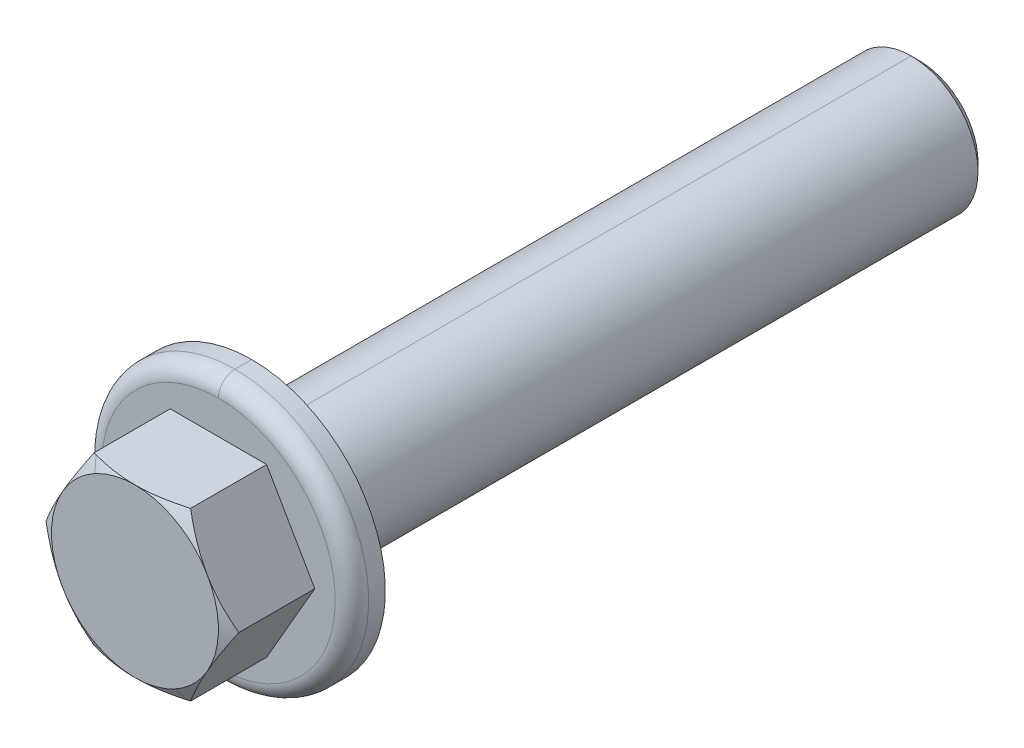
ISO-10303-21;
HEADER;
FILE_DESCRIPTION(('STEP AP214'),'2;1');
FILE_NAME('part.step','',(''),(''),'','','');
FILE_SCHEMA(('AUTOMOTIVE_DESIGN { 1 0 10303 214 1 1 1 1 }'));
ENDSEC;
DATA;
#1=APPLICATION_CONTEXT('core data for automotive mechanical design processes');
#2=APPLICATION_PROTOCOL_DEFINITION('international standard','automotive_design',2000,#1);
#3=PRODUCT_CONTEXT('',#1,'mechanical');
#4=PRODUCT('Part','Part','',(#3));
#5=PRODUCT_RELATED_PRODUCT_CATEGORY('part','',(#4));
#6=PRODUCT_DEFINITION_FORMATION('','',#4);
#7=PRODUCT_DEFINITION_CONTEXT('part definition',#1,'design');
#8=PRODUCT_DEFINITION('design','',#6,#7);
#9=PRODUCT_DEFINITION_SHAPE('','',#8);
#10=(LENGTH_UNIT() NAMED_UNIT(*) SI_UNIT(.MILLI.,.METRE.));
#11=(NAMED_UNIT(*) PLANE_ANGLE_UNIT() SI_UNIT($,.RADIAN.));
#12=(NAMED_UNIT(*) SI_UNIT($,.STERADIAN.) SOLID_ANGLE_UNIT());
#13=UNCERTAINTY_MEASURE_WITH_UNIT(LENGTH_MEASURE(1.E-05),#10,'distance_accuracy_value','');
#14=(GEOMETRIC_REPRESENTATION_CONTEXT(3) GLOBAL_UNCERTAINTY_ASSIGNED_CONTEXT((#13)) GLOBAL_UNIT_ASSIGNED_CONTEXT((#10,
#11,#12)) REPRESENTATION_CONTEXT('',''));
#15=CARTESIAN_POINT('',(0.,0.,0.));
#16=DIRECTION('',(0.,0.,1.));
#17=DIRECTION('',(1.,0.,0.));
#18=AXIS2_PLACEMENT_3D('',#15,#16,#17);
#19=CARTESIAN_POINT('',(-62.,72.,24.3));
#20=DIRECTION('',(0.,0.,1.));
#21=DIRECTION('',(-1.,0.,0.));
#22=AXIS2_PLACEMENT_3D('',#19,#20,#21);
#23=TOROIDAL_SURFACE('',#22,4.25,0.25);
#24=CARTESIAN_POINT('',(-62.,72.,24.55));
#25=DIRECTION('',(0.,0.,-1.));
#26=DIRECTION('',(1.,0.,0.));
#27=AXIS2_PLACEMENT_3D('',#24,#25,#26);
#28=CIRCLE('',#27,4.25);
#29=CARTESIAN_POINT('',(-62.,76.25,24.55));
#30=VERTEX_POINT('',#29);
#31=CARTESIAN_POINT('',(-62.,67.75,24.55));
#32=VERTEX_POINT('',#31);
#33=EDGE_CURVE('E11',#30,#32,#28,.T.);
#34=ORIENTED_EDGE('',*,*,#33,.T.);
#35=CARTESIAN_POINT('',(-62.,67.75,24.3));
#36=DIRECTION('',(-1.,0.,0.));
#37=DIRECTION('',(0.,0.,1.));
#38=AXIS2_PLACEMENT_3D('',#35,#36,#37);
#39=CIRCLE('',#38,0.25);
#40=CARTESIAN_POINT('',(-62.,68.,24.3));
#41=VERTEX_POINT('',#40);
#42=EDGE_CURVE('E33',#32,#41,#39,.T.);
#43=ORIENTED_EDGE('',*,*,#42,.T.);
#44=CARTESIAN_POINT('',(-62.,72.,24.3));
#45=DIRECTION('',(0.,0.,-1.));
#46=DIRECTION('',(1.,0.,0.));
#47=AXIS2_PLACEMENT_3D('',#44,#45,#46);
#48=CIRCLE('',#47,4.);
#49=CARTESIAN_POINT('',(-62.,76.,24.3));
#50=VERTEX_POINT('',#49);
#51=EDGE_CURVE('E461',#50,#41,#48,.T.);
#52=ORIENTED_EDGE('',*,*,#51,.F.);
#53=CARTESIAN_POINT('',(-62.,76.25,24.3));
#54=DIRECTION('',(1.,0.,0.));
#55=DIRECTION('',(0.,0.,1.));
#56=AXIS2_PLACEMENT_3D('',#53,#54,#55);
#57=CIRCLE('',#56,0.25);
#58=EDGE_CURVE('E457',#30,#50,#57,.T.);
#59=ORIENTED_EDGE('',*,*,#58,.F.);
#60=EDGE_LOOP('',(#34,#43,#52,#59));
#61=FACE_BOUND('',#60,.T.);
#62=ADVANCED_FACE('F17',(#61),#23,.F.);
#63=CARTESIAN_POINT('',(-62.,72.,24.3));
#64=DIRECTION('',(0.,0.,1.));
#65=DIRECTION('',(0.,-1.,0.));
#66=AXIS2_PLACEMENT_3D('',#63,#64,#65);
#67=TOROIDAL_SURFACE('',#66,4.25,0.25);
#68=CARTESIAN_POINT('',(-62.,72.,24.55));
#69=DIRECTION('',(0.,0.,-1.));
#70=DIRECTION('',(1.,0.,0.));
#71=AXIS2_PLACEMENT_3D('',#68,#69,#70);
#72=CIRCLE('',#71,4.25);
#73=EDGE_CURVE('E454',#32,#30,#72,.T.);
#74=ORIENTED_EDGE('',*,*,#73,.T.);
#75=ORIENTED_EDGE('',*,*,#58,.T.);
#76=CARTESIAN_POINT('',(-62.,72.,24.3));
#77=DIRECTION('',(0.,0.,-1.));
#78=DIRECTION('',(1.,0.,0.));
#79=AXIS2_PLACEMENT_3D('',#76,#77,#78);
#80=CIRCLE('',#79,4.);
#81=EDGE_CURVE('E465',#41,#50,#80,.T.);
#82=ORIENTED_EDGE('',*,*,#81,.F.);
#83=ORIENTED_EDGE('',*,*,#42,.F.);
#84=EDGE_LOOP('',(#74,#75,#82,#83));
#85=FACE_BOUND('',#84,.T.);
#86=ADVANCED_FACE('F311',(#85),#67,.F.);
#87=CARTESIAN_POINT('',(-62.,72.,4.55));
#88=DIRECTION('',(0.,0.,1.));
#89=DIRECTION('',(-1.,0.,0.));
#90=AXIS2_PLACEMENT_3D('',#87,#88,#89);
#91=CYLINDRICAL_SURFACE('',#90,4.);
#92=DIRECTION('',(0.,0.,-1.));
#93=VECTOR('',#92,1.);
#94=CARTESIAN_POINT('',(-62.,76.,4.55));
#95=LINE('',#94,#93);
#96=CARTESIAN_POINT('',(-62.,76.,-14.95));
#97=VERTEX_POINT('',#96);
#98=EDGE_CURVE('E468',#50,#97,#95,.T.);
#99=ORIENTED_EDGE('',*,*,#98,.F.);
#100=ORIENTED_EDGE('',*,*,#51,.T.);
#101=DIRECTION('',(0.,0.,-1.));
#102=VECTOR('',#101,1.);
#103=CARTESIAN_POINT('',(-62.,68.,4.55));
#104=LINE('',#103,#102);
#105=CARTESIAN_POINT('',(-62.,68.,-14.95));
#106=VERTEX_POINT('',#105);
#107=EDGE_CURVE('E472',#41,#106,#104,.T.);
#108=ORIENTED_EDGE('',*,*,#107,.T.);
#109=CARTESIAN_POINT('',(-62.,72.,-14.95));
#110=DIRECTION('',(0.,0.,1.));
#111=DIRECTION('',(1.,0.,0.));
#112=AXIS2_PLACEMENT_3D('',#109,#110,#111);
#113=CIRCLE('',#112,4.);
#114=EDGE_CURVE('E467',#106,#97,#113,.T.);
#115=ORIENTED_EDGE('',*,*,#114,.T.);
#116=EDGE_LOOP('',(#99,#100,#108,#115));
#117=FACE_BOUND('',#116,.T.);
#118=ADVANCED_FACE('F317',(#117),#91,.T.);
#119=CARTESIAN_POINT('',(-62.,72.,4.55));
#120=DIRECTION('',(0.,0.,1.));
#121=DIRECTION('',(-1.,0.,0.));
#122=AXIS2_PLACEMENT_3D('',#119,#120,#121);
#123=CYLINDRICAL_SURFACE('',#122,4.);
#124=ORIENTED_EDGE('',*,*,#107,.F.);
#125=ORIENTED_EDGE('',*,*,#81,.T.);
#126=ORIENTED_EDGE('',*,*,#98,.T.);
#127=CARTESIAN_POINT('',(-62.,72.,-14.95));
#128=DIRECTION('',(0.,0.,1.));
#129=DIRECTION('',(1.,0.,0.));
#130=AXIS2_PLACEMENT_3D('',#127,#128,#129);
#131=CIRCLE('',#130,4.);
#132=EDGE_CURVE('E471',#97,#106,#131,.T.);
#133=ORIENTED_EDGE('',*,*,#132,.T.);
#134=EDGE_LOOP('',(#124,#125,#126,#133));
#135=FACE_BOUND('',#134,.T.);
#136=ADVANCED_FACE('F322',(#135),#123,.T.);
#137=CARTESIAN_POINT('',(-62.,72.,-18.95));
#138=DIRECTION('',(0.,0.,1.));
#139=DIRECTION('',(-0.274319226534887,-0.961638685761602,0.));
#140=AXIS2_PLACEMENT_3D('',#137,#138,#139);
#141=CONICAL_SURFACE('',#140,0.,0.785398163396999);
#142=DIRECTION('',(1.71127574250888E-07,0.707106781186537,-0.707106781186537));
#143=VECTOR('',#142,1.);
#144=CARTESIAN_POINT('',(-62.0000009075411,68.25,-15.2));
#145=LINE('',#144,#143);
#146=CARTESIAN_POINT('',(-62.0000002619931,68.5,-15.45));
#147=VERTEX_POINT('',#146);
#148=EDGE_CURVE('E478',#106,#147,#145,.T.);
#149=ORIENTED_EDGE('',*,*,#148,.T.);
#150=CARTESIAN_POINT('',(-62.,72.,-15.45));
#151=DIRECTION('',(0.,0.,1.));
#152=DIRECTION('',(-0.961638685761684,0.2743192265346,0.));
#153=AXIS2_PLACEMENT_3D('',#150,#151,#152);
#154=CIRCLE('',#153,3.5);
#155=CARTESIAN_POINT('',(-62.,75.5,-15.45));
#156=VERTEX_POINT('',#155);
#157=EDGE_CURVE('E481',#147,#156,#154,.T.);
#158=ORIENTED_EDGE('',*,*,#157,.T.);
#159=DIRECTION('',(0.,-0.707106781186548,-0.707106781186548));
#160=VECTOR('',#159,1.);
#161=CARTESIAN_POINT('',(-62.,75.75,-15.2));
#162=LINE('',#161,#160);
#163=EDGE_CURVE('E484',#97,#156,#162,.T.);
#164=ORIENTED_EDGE('',*,*,#163,.F.);
#165=ORIENTED_EDGE('',*,*,#114,.F.);
#166=EDGE_LOOP('',(#149,#158,#164,#165));
#167=FACE_BOUND('',#166,.T.);
#168=ADVANCED_FACE('F326',(#167),#141,.T.);
#169=CARTESIAN_POINT('',(-62.0000000000012,71.9999999999992,-18.95));
#170=DIRECTION('',(3.05977465587E-13,1.97175609173E-13,1.));
#171=DIRECTION('',(0.,1.,-1.97175609173E-13));
#172=AXIS2_PLACEMENT_3D('',#169,#170,#171);
#173=CONICAL_SURFACE('',#172,0.,0.785398163396999);
#174=ORIENTED_EDGE('',*,*,#163,.T.);
#175=CARTESIAN_POINT('',(-62.,72.,-15.4499999999993));
#176=DIRECTION('',(3.05977465587E-13,0.,1.));
#177=DIRECTION('',(-1.,0.,3.05977465587E-13));
#178=AXIS2_PLACEMENT_3D('',#175,#176,#177);
#179=CIRCLE('',#178,3.5);
#180=EDGE_CURVE('E352',#156,#147,#179,.T.);
#181=ORIENTED_EDGE('',*,*,#180,.T.);
#182=ORIENTED_EDGE('',*,*,#148,.F.);
#183=ORIENTED_EDGE('',*,*,#132,.F.);
#184=EDGE_LOOP('',(#174,#181,#182,#183));
#185=FACE_BOUND('',#184,.T.);
#186=ADVANCED_FACE('F330',(#185),#173,.T.);
#187=CARTESIAN_POINT('',(-62.,72.,-15.45));
#188=DIRECTION('',(0.,0.,1.));
#189=DIRECTION('',(0.,-1.,0.));
#190=AXIS2_PLACEMENT_3D('',#187,#188,#189);
#191=PLANE('',#190);
#192=ORIENTED_EDGE('',*,*,#180,.F.);
#193=ORIENTED_EDGE('',*,*,#157,.F.);
#194=EDGE_LOOP('',(#192,#193));
#195=FACE_BOUND('',#194,.T.);
#196=ADVANCED_FACE('F334',(#195),#191,.F.);
#197=CARTESIAN_POINT('',(-62.,72.,31.55));
#198=DIRECTION('',(0.,0.,1.));
#199=DIRECTION('',(-1.,0.,0.));
#200=AXIS2_PLACEMENT_3D('',#197,#198,#199);
#201=PLANE('',#200);
#202=CARTESIAN_POINT('',(-62.,72.,31.55));
#203=DIRECTION('',(0.,0.,1.));
#204=DIRECTION('',(1.,0.,0.));
#205=AXIS2_PLACEMENT_3D('',#202,#203,#204);
#206=CIRCLE('',#205,5.);
#207=CARTESIAN_POINT('',(-66.3301270189226,74.5000000000015,31.5499999999994));
#208=VERTEX_POINT('',#207);
#209=CARTESIAN_POINT('',(-66.3301270189228,69.4999999999984,31.5499999999993));
#210=VERTEX_POINT('',#209);
#211=EDGE_CURVE('E347',#208,#210,#206,.T.);
#212=ORIENTED_EDGE('',*,*,#211,.T.);
#213=CARTESIAN_POINT('',(-62.,72.,31.55));
#214=DIRECTION('',(0.,0.,1.));
#215=DIRECTION('',(1.,0.,0.));
#216=AXIS2_PLACEMENT_3D('',#213,#214,#215);
#217=CIRCLE('',#216,5.);
#218=CARTESIAN_POINT('',(-62.,67.,31.55));
#219=VERTEX_POINT('',#218);
#220=EDGE_CURVE('E353',#210,#219,#217,.T.);
#221=ORIENTED_EDGE('',*,*,#220,.T.);
#222=CARTESIAN_POINT('',(-62.,72.,31.55));
#223=DIRECTION('',(0.,0.,1.));
#224=DIRECTION('',(1.,0.,0.));
#225=AXIS2_PLACEMENT_3D('',#222,#223,#224);
#226=CIRCLE('',#225,5.);
#227=CARTESIAN_POINT('',(-59.60287230698,67.61208719055,31.55));
#228=VERTEX_POINT('',#227);
#229=EDGE_CURVE('E368',#219,#228,#226,.T.);
#230=ORIENTED_EDGE('',*,*,#229,.T.);
#231=CARTESIAN_POINT('',(-62.,72.,31.55));
#232=DIRECTION('',(0.,0.,1.));
#233=DIRECTION('',(1.,0.,0.));
#234=AXIS2_PLACEMENT_3D('',#231,#232,#233);
#235=CIRCLE('',#234,5.);
#236=CARTESIAN_POINT('',(-57.6698729810774,69.4999999999985,31.5499999999994));
#237=VERTEX_POINT('',#236);
#238=EDGE_CURVE('E372',#228,#237,#235,.T.);
#239=ORIENTED_EDGE('',*,*,#238,.T.);
#240=CARTESIAN_POINT('',(-62.,72.,31.55));
#241=DIRECTION('',(0.,0.,1.));
#242=DIRECTION('',(1.,0.,0.));
#243=AXIS2_PLACEMENT_3D('',#240,#241,#242);
#244=CIRCLE('',#243,5.);
#245=CARTESIAN_POINT('',(-57.6698729810772,74.5000000000016,31.5499999999993));
#246=VERTEX_POINT('',#245);
#247=EDGE_CURVE('E172',#237,#246,#244,.T.);
#248=ORIENTED_EDGE('',*,*,#247,.T.);
#249=CARTESIAN_POINT('',(-62.,72.,31.55));
#250=DIRECTION('',(0.,0.,1.));
#251=DIRECTION('',(1.,0.,0.));
#252=AXIS2_PLACEMENT_3D('',#249,#250,#251);
#253=CIRCLE('',#252,5.);
#254=CARTESIAN_POINT('',(-62.,77.,31.55));
#255=VERTEX_POINT('',#254);
#256=EDGE_CURVE('E147',#246,#255,#253,.T.);
#257=ORIENTED_EDGE('',*,*,#256,.T.);
#258=CARTESIAN_POINT('',(-62.,72.,31.55));
#259=DIRECTION('',(0.,0.,1.));
#260=DIRECTION('',(1.,0.,0.));
#261=AXIS2_PLACEMENT_3D('',#258,#259,#260);
#262=CIRCLE('',#261,5.);
#263=CARTESIAN_POINT('',(-64.39712769302,76.38791280945,31.55));
#264=VERTEX_POINT('',#263);
#265=EDGE_CURVE('E160',#255,#264,#262,.T.);
#266=ORIENTED_EDGE('',*,*,#265,.T.);
#267=CARTESIAN_POINT('',(-62.,72.,31.55));
#268=DIRECTION('',(0.,0.,1.));
#269=DIRECTION('',(1.,0.,0.));
#270=AXIS2_PLACEMENT_3D('',#267,#268,#269);
#271=CIRCLE('',#270,5.);
#272=EDGE_CURVE('E166',#264,#208,#271,.T.);
#273=ORIENTED_EDGE('',*,*,#272,.T.);
#274=EDGE_LOOP('',(#212,#221,#230,#239,#248,#257,#266,#273));
#275=FACE_BOUND('',#274,.T.);
#276=ADVANCED_FACE('F169',(#275),#201,.T.);
#277=CARTESIAN_POINT('',(-62.,72.,31.55));
#278=DIRECTION('',(0.,0.,-1.));
#279=DIRECTION('',(-0.479425538604204,0.877582561890372,0.));
#280=AXIS2_PLACEMENT_3D('',#277,#278,#279);
#281=CONICAL_SURFACE('',#280,5.,1.0471975512);
#282=ORIENTED_EDGE('',*,*,#211,.F.);
#283=CARTESIAN_POINT('',(-67.7735026919003,71.9999999999987,31.103418012616));
#284=CARTESIAN_POINT('',(-67.6560125271063,72.2034989348116,31.1712680083954));
#285=CARTESIAN_POINT('',(-67.5375814588518,72.4086275622228,31.233430450311));
#286=CARTESIAN_POINT('',(-67.2996753641851,72.8206930056157,31.343052797405));
#287=CARTESIAN_POINT('',(-67.1802086361519,73.027615448383,31.39058540343));
#288=CARTESIAN_POINT('',(-66.9998810681284,73.3399519582049,31.4489473736349));
#289=CARTESIAN_POINT('',(-66.9395440864799,73.4444586759954,31.4662522919644));
#290=CARTESIAN_POINT('',(-66.8185812654574,73.6539724278332,31.4962074663217));
#291=CARTESIAN_POINT('',(-66.7579554337286,73.7589794486386,31.5088578448606));
#292=CARTESIAN_POINT('',(-66.6361906650968,73.9698822144807,31.5292816727016));
#293=CARTESIAN_POINT('',(-66.5750506802064,74.0757797746848,31.5370303207411));
#294=CARTESIAN_POINT('',(-66.4526504678771,74.2877831612961,31.5474002095299));
#295=CARTESIAN_POINT('',(-66.3913902190284,74.3938890247864,31.5500204348124));
#296=CARTESIAN_POINT('',(-66.3301270189236,74.5000000000021,31.5499999999987));
#297=B_SPLINE_CURVE_WITH_KNOTS('',3,(#283,#284,#285,#286,#287,#288,#289,#290,#291,#292,#293,
#294,#295,#296),.UNSPECIFIED.,.F.,.F.,(4,2,2,2,2,2,4),(0.,0.734036658391598,1.46436443241698,
1.8300074907837,2.19564092445858,2.56310985866724,2.93065154716806),.UNSPECIFIED.);
#298=CARTESIAN_POINT('',(-67.7735026919005,72.,31.1034180126159));
#299=VERTEX_POINT('',#298);
#300=EDGE_CURVE('E218',#299,#208,#297,.T.);
#301=ORIENTED_EDGE('',*,*,#300,.F.);
#302=CARTESIAN_POINT('',(-66.3301270189239,69.4999999999978,31.5499999999985));
#303=CARTESIAN_POINT('',(-66.3913902190287,69.6061109752135,31.5500204348122));
#304=CARTESIAN_POINT('',(-66.4526504678775,69.7122168387038,31.5474002095297));
#305=CARTESIAN_POINT('',(-66.5750506802067,69.9242202253151,31.5370303207409));
#306=CARTESIAN_POINT('',(-66.6361906650971,70.0301177855192,31.5292816727013));
#307=CARTESIAN_POINT('',(-66.7579554337289,70.2410205513613,31.5088578448604));
#308=CARTESIAN_POINT('',(-66.8185812654577,70.3460275721666,31.4962074663215));
#309=CARTESIAN_POINT('',(-66.9395440864803,70.5555413240045,31.4662522919642));
#310=CARTESIAN_POINT('',(-66.9998810681287,70.6600480417949,31.4489473736347));
#311=CARTESIAN_POINT('',(-67.1802086361522,70.9723845516168,31.3905854034298));
#312=CARTESIAN_POINT('',(-67.2996753641854,71.1793069943842,31.3430527974048));
#313=CARTESIAN_POINT('',(-67.5375814588521,71.591372437777,31.2334304503108));
#314=CARTESIAN_POINT('',(-67.6560125271066,71.7965010651882,31.1712680083952));
#315=CARTESIAN_POINT('',(-67.7735026919006,72.0000000000011,31.1034180126158));
#316=B_SPLINE_CURVE_WITH_KNOTS('',3,(#302,#303,#304,#305,#306,#307,#308,#309,#310,#311,#312,
#313,#314,#315),.UNSPECIFIED.,.F.,.F.,(4,2,2,2,2,2,4),(0.,0.367541688500812,0.735010622709445,
1.10064405638434,1.46628711475104,2.19661488877642,2.93065154716796),.UNSPECIFIED.);
#317=EDGE_CURVE('E234',#210,#299,#316,.T.);
#318=ORIENTED_EDGE('',*,*,#317,.F.);
#319=EDGE_LOOP('',(#282,#301,#318));
#320=FACE_BOUND('',#319,.T.);
#321=ADVANCED_FACE('F248',(#320),#281,.T.);
#322=CARTESIAN_POINT('',(-62.,72.,31.55));
#323=DIRECTION('',(0.,0.,-1.));
#324=DIRECTION('',(-0.479425538604204,0.877582561890372,0.));
#325=AXIS2_PLACEMENT_3D('',#322,#323,#324);
#326=CONICAL_SURFACE('',#325,5.,1.0471975512);
#327=ORIENTED_EDGE('',*,*,#220,.F.);
#328=CARTESIAN_POINT('',(-64.8867513459496,66.9999999999986,31.1034180126172));
#329=CARTESIAN_POINT('',(-65.0042415107435,67.2034989348111,31.1712680083964));
#330=CARTESIAN_POINT('',(-65.1226725789977,67.408627562222,31.2334304503118));
#331=CARTESIAN_POINT('',(-65.360578673664,67.8206930056142,31.3430527974055));
#332=CARTESIAN_POINT('',(-65.4800454016971,68.0276154483813,31.3905854034304));
#333=CARTESIAN_POINT('',(-65.6603729697202,68.3399519582026,31.4489473736351));
#334=CARTESIAN_POINT('',(-65.7207099513686,68.4444586759929,31.4662522919645));
#335=CARTESIAN_POINT('',(-65.841672772391,68.6539724278304,31.4962074663217));
#336=CARTESIAN_POINT('',(-65.9022986041197,68.7589794486355,31.5088578448605));
#337=CARTESIAN_POINT('',(-66.0240633727513,68.9698822144773,31.5292816727014));
#338=CARTESIAN_POINT('',(-66.0852033576416,69.0757797746812,31.5370303207409));
#339=CARTESIAN_POINT('',(-66.2076035699706,69.2877831612922,31.5474002095297));
#340=CARTESIAN_POINT('',(-66.2688638188192,69.3938890247823,31.5500204348122));
#341=CARTESIAN_POINT('',(-66.3301270189239,69.4999999999978,31.5499999999985));
#342=B_SPLINE_CURVE_WITH_KNOTS('',3,(#328,#329,#330,#331,#332,#333,#334,#335,#336,#337,#338,
#339,#340,#341),.UNSPECIFIED.,.F.,.F.,(4,2,2,2,2,2,4),(0.,0.734036658390328,1.46436443241448,
1.83000749078056,2.19564092445482,2.56310985866282,2.93065154716303),.UNSPECIFIED.);
#343=CARTESIAN_POINT('',(-64.8867513459506,67.,31.1034180126173));
#344=VERTEX_POINT('',#343);
#345=EDGE_CURVE('E225',#344,#210,#342,.T.);
#346=ORIENTED_EDGE('',*,*,#345,.F.);
#347=CARTESIAN_POINT('',(-62.,67.,31.55));
#348=CARTESIAN_POINT('',(-62.1225264002095,67.,31.5500204348137));
#349=CARTESIAN_POINT('',(-62.2450468979069,67.,31.5474002095312));
#350=CARTESIAN_POINT('',(-62.4898473225652,67.,31.5370303207424));
#351=CARTESIAN_POINT('',(-62.6121272923459,67.,31.5292816727029));
#352=CARTESIAN_POINT('',(-62.8556568296094,67.,31.5088578448619));
#353=CARTESIAN_POINT('',(-62.9769084930669,67.,31.496207466323));
#354=CARTESIAN_POINT('',(-63.2188341351119,67.,31.4662522919657));
#355=CARTESIAN_POINT('',(-63.3395080984088,67.,31.4489473736362));
#356=CARTESIAN_POINT('',(-63.7001632344556,67.,31.3905854034313));
#357=CARTESIAN_POINT('',(-63.9390966905218,67.,31.3430527974063));
#358=CARTESIAN_POINT('',(-64.4149088798549,67.,31.2334304503123));
#359=CARTESIAN_POINT('',(-64.6517710163636,67.,31.1712680083967));
#360=CARTESIAN_POINT('',(-64.8867513459516,67.,31.1034180126173));
#361=B_SPLINE_CURVE_WITH_KNOTS('',3,(#347,#348,#349,#350,#351,#352,#353,#354,#355,#356,#357,
#358,#359,#360),.UNSPECIFIED.,.F.,.F.,(4,2,2,2,2,2,4),(0.,0.367541688500726,0.73501062270927,
1.10064405638407,1.46628711475069,2.19661488877589,2.93065154716729),.UNSPECIFIED.);
#362=EDGE_CURVE('E256',#219,#344,#361,.T.);
#363=ORIENTED_EDGE('',*,*,#362,.F.);
#364=EDGE_LOOP('',(#327,#346,#363));
#365=FACE_BOUND('',#364,.T.);
#366=ADVANCED_FACE('F243',(#365),#326,.T.);
#367=CARTESIAN_POINT('',(-62.,72.,31.55));
#368=DIRECTION('',(0.,0.,-1.));
#369=DIRECTION('',(-0.479425538604204,0.877582561890372,0.));
#370=AXIS2_PLACEMENT_3D('',#367,#368,#369);
#371=CONICAL_SURFACE('',#370,5.,1.0471975512);
#372=DIRECTION('',(-0.41519469565414,0.760008792515256,0.500000000000169));
#373=VECTOR('',#372,1.);
#374=CARTESIAN_POINT('',(-58.53326570462,65.65418543787,30.2619216436));
#375=LINE('',#374,#373);
#376=CARTESIAN_POINT('',(-59.2684875507787,67.,31.147315717563));
#377=VERTEX_POINT('',#376);
#378=EDGE_CURVE('E359',#377,#228,#375,.T.);
#379=ORIENTED_EDGE('',*,*,#378,.T.);
#380=ORIENTED_EDGE('',*,*,#229,.F.);
#381=CARTESIAN_POINT('',(-59.2684875507779,67.,31.1473157175466));
#382=CARTESIAN_POINT('',(-59.4912169044079,67.,31.2089939702808));
#383=CARTESIAN_POINT('',(-59.7156343848346,67.,31.2652901400358));
#384=CARTESIAN_POINT('',(-60.1663195083866,67.,31.3643275190334));
#385=CARTESIAN_POINT('',(-60.3925736486693,67.,31.4071306974178));
#386=CARTESIAN_POINT('',(-60.7338882902849,67.,31.4595623012601));
#387=CARTESIAN_POINT('',(-60.8480458466854,67.,31.4750826376561));
#388=CARTESIAN_POINT('',(-61.0768554025112,67.,31.5019229351795));
#389=CARTESIAN_POINT('',(-61.1915073925249,67.,31.5132429759078));
#390=CARTESIAN_POINT('',(-61.4216968591126,67.,31.5315033490444));
#391=CARTESIAN_POINT('',(-61.5372359766045,67.,31.5384231328082));
#392=CARTESIAN_POINT('',(-61.7685152128013,67.,31.5476799879822));
#393=CARTESIAN_POINT('',(-61.8842553604208,67.,31.5500163340107));
#394=CARTESIAN_POINT('',(-62.,67.,31.55));
#395=B_SPLINE_CURVE_WITH_KNOTS('',3,(#381,#382,#383,#384,#385,#386,#387,#388,#389,#390,#391,
#392,#393,#394),.UNSPECIFIED.,.F.,.F.,(4,2,2,2,2,2,4),(0.,0.693572709725173,1.38391201165257,
1.72946469135578,2.07501082206928,2.4221589832928,2.76936208027052),.UNSPECIFIED.);
#396=EDGE_CURVE('E262',#377,#219,#395,.T.);
#397=ORIENTED_EDGE('',*,*,#396,.F.);
#398=EDGE_LOOP('',(#379,#380,#397));
#399=FACE_BOUND('',#398,.T.);
#400=ADVANCED_FACE('F247',(#399),#371,.T.);
#401=CARTESIAN_POINT('',(-62.,72.,31.55));
#402=DIRECTION('',(0.,0.,-1.));
#403=DIRECTION('',(-0.479425538604204,0.877582561890372,0.));
#404=AXIS2_PLACEMENT_3D('',#401,#402,#403);
#405=CONICAL_SURFACE('',#404,5.,1.0471975512);
#406=ORIENTED_EDGE('',*,*,#238,.F.);
#407=ORIENTED_EDGE('',*,*,#378,.F.);
#408=CARTESIAN_POINT('',(-59.26848755078,67.,31.1473157175));
#409=CARTESIAN_POINT('',(-59.21741218956,67.,31.1331782382));
#410=CARTESIAN_POINT('',(-59.16568415406,67.,31.1185548376));
#411=CARTESIAN_POINT('',(-59.11324865405,67.,31.1034180126));
#412=B_SPLINE_CURVE_WITH_KNOTS('',3,(#408,#409,#410,#411),.UNSPECIFIED.,.F.,.F.,(4,4),(0.,1.),.UNSPECIFIED.);
#413=CARTESIAN_POINT('',(-59.1132486540512,66.999999999998,31.1034180126082));
#414=VERTEX_POINT('',#413);
#415=EDGE_CURVE('E362',#377,#414,#412,.T.);
#416=ORIENTED_EDGE('',*,*,#415,.T.);
#417=CARTESIAN_POINT('',(-57.6698729810764,69.4999999999979,31.5499999999987));
#418=CARTESIAN_POINT('',(-57.7311361811812,69.3938890247822,31.5500204348124));
#419=CARTESIAN_POINT('',(-57.7923964300299,69.287783161292,31.5474002095299));
#420=CARTESIAN_POINT('',(-57.9147966423591,69.0757797746808,31.5370303207411));
#421=CARTESIAN_POINT('',(-57.9759366272494,68.9698822144768,31.5292816727016));
#422=CARTESIAN_POINT('',(-58.0977013958812,68.7589794486348,31.5088578448606));
#423=CARTESIAN_POINT('',(-58.1583272276099,68.6539724278295,31.4962074663218));
#424=CARTESIAN_POINT('',(-58.2792900486324,68.4444586759918,31.4662522919645));
#425=CARTESIAN_POINT('',(-58.3396270302809,68.3399519582014,31.448947373635));
#426=CARTESIAN_POINT('',(-58.5199545983043,68.0276154483797,31.3905854034302));
#427=CARTESIAN_POINT('',(-58.6394213263374,67.8206930056124,31.3430527974052));
#428=CARTESIAN_POINT('',(-58.877327421004,67.4086275622197,31.2334304503113));
#429=CARTESIAN_POINT('',(-58.9957584892584,67.2034989348086,31.1712680083957));
#430=CARTESIAN_POINT('',(-59.1132486540524,66.9999999999959,31.1034180126164));
#431=B_SPLINE_CURVE_WITH_KNOTS('',3,(#417,#418,#419,#420,#421,#422,#423,#424,#425,#426,#427,
#428,#429,#430),.UNSPECIFIED.,.F.,.F.,(4,2,2,2,2,2,4),(0.,0.367541688500619,0.735010622709054,
1.10064405638377,1.46628711475027,2.19661488877526,2.93065154716644),.UNSPECIFIED.);
#432=EDGE_CURVE('E287',#237,#414,#431,.T.);
#433=ORIENTED_EDGE('',*,*,#432,.F.);
#434=EDGE_LOOP('',(#406,#407,#416,#433));
#435=FACE_BOUND('',#434,.T.);
#436=ADVANCED_FACE('F297',(#435),#405,.T.);
#437=CARTESIAN_POINT('',(-62.,72.,31.55));
#438=DIRECTION('',(0.,0.,-1.));
#439=DIRECTION('',(-0.479425538604204,0.877582561890372,0.));
#440=AXIS2_PLACEMENT_3D('',#437,#438,#439);
#441=CONICAL_SURFACE('',#440,5.,1.0471975512);
#442=ORIENTED_EDGE('',*,*,#247,.F.);
#443=CARTESIAN_POINT('',(-56.2264973080997,72.0000000000013,31.103418012616));
#444=CARTESIAN_POINT('',(-56.3439874728937,71.7965010651884,31.1712680083954));
#445=CARTESIAN_POINT('',(-56.4624185411482,71.5913724377772,31.233430450311));
#446=CARTESIAN_POINT('',(-56.7003246358149,71.1793069943843,31.343052797405));
#447=CARTESIAN_POINT('',(-56.8197913638481,70.9723845516169,31.39058540343));
#448=CARTESIAN_POINT('',(-57.0001189318716,70.6600480417951,31.4489473736349));
#449=CARTESIAN_POINT('',(-57.0604559135201,70.5555413240046,31.4662522919644));
#450=CARTESIAN_POINT('',(-57.1814187345426,70.3460275721667,31.4962074663217));
#451=CARTESIAN_POINT('',(-57.2420445662714,70.2410205513614,31.5088578448606));
#452=CARTESIAN_POINT('',(-57.3638093349033,70.0301177855194,31.5292816727016));
#453=CARTESIAN_POINT('',(-57.4249493197937,69.9242202253152,31.5370303207411));
#454=CARTESIAN_POINT('',(-57.5473495321229,69.7122168387039,31.5474002095299));
#455=CARTESIAN_POINT('',(-57.6086097809716,69.6061109752136,31.5500204348124));
#456=CARTESIAN_POINT('',(-57.6698729810764,69.4999999999979,31.5499999999987));
#457=B_SPLINE_CURVE_WITH_KNOTS('',3,(#443,#444,#445,#446,#447,#448,#449,#450,#451,#452,#453,
#454,#455,#456),.UNSPECIFIED.,.F.,.F.,(4,2,2,2,2,2,4),(0.,0.734036658391598,1.46436443241699,
1.83000749078371,2.1956409244586,2.56310985866725,2.93065154716807),.UNSPECIFIED.);
#458=CARTESIAN_POINT('',(-56.2264973080995,72.,31.1034180126159));
#459=VERTEX_POINT('',#458);
#460=EDGE_CURVE('E268',#459,#237,#457,.T.);
#461=ORIENTED_EDGE('',*,*,#460,.F.);
#462=CARTESIAN_POINT('',(-57.6698729810761,74.5000000000022,31.5499999999985));
#463=CARTESIAN_POINT('',(-57.6086097809713,74.3938890247865,31.5500204348122));
#464=CARTESIAN_POINT('',(-57.5473495321225,74.2877831612962,31.5474002095297));
#465=CARTESIAN_POINT('',(-57.4249493197933,74.0757797746849,31.5370303207409));
#466=CARTESIAN_POINT('',(-57.3638093349029,73.9698822144808,31.5292816727014));
#467=CARTESIAN_POINT('',(-57.2420445662711,73.7589794486387,31.5088578448604));
#468=CARTESIAN_POINT('',(-57.1814187345423,73.6539724278334,31.4962074663215));
#469=CARTESIAN_POINT('',(-57.0604559135197,73.4444586759955,31.4662522919642));
#470=CARTESIAN_POINT('',(-57.0001189318713,73.3399519582051,31.4489473736347));
#471=CARTESIAN_POINT('',(-56.8197913638478,73.0276154483832,31.3905854034298));
#472=CARTESIAN_POINT('',(-56.7003246358146,72.8206930056158,31.3430527974048));
#473=CARTESIAN_POINT('',(-56.4624185411479,72.408627562223,31.2334304503108));
#474=CARTESIAN_POINT('',(-56.3439874728934,72.2034989348118,31.1712680083952));
#475=CARTESIAN_POINT('',(-56.2264973080994,71.9999999999989,31.1034180126158));
#476=B_SPLINE_CURVE_WITH_KNOTS('',3,(#462,#463,#464,#465,#466,#467,#468,#469,#470,#471,#472,
#473,#474,#475),.UNSPECIFIED.,.F.,.F.,(4,2,2,2,2,2,4),(0.,0.367541688500815,0.735010622709461,
1.10064405638434,1.46628711475104,2.19661488877642,2.93065154716797),.UNSPECIFIED.);
#477=EDGE_CURVE('E188',#246,#459,#476,.T.);
#478=ORIENTED_EDGE('',*,*,#477,.F.);
#479=EDGE_LOOP('',(#442,#461,#478));
#480=FACE_BOUND('',#479,.T.);
#481=ADVANCED_FACE('F300',(#480),#441,.T.);
#482=CARTESIAN_POINT('',(-62.,72.,31.55));
#483=DIRECTION('',(0.,0.,-1.));
#484=DIRECTION('',(-0.479425538604204,0.877582561890372,0.));
#485=AXIS2_PLACEMENT_3D('',#482,#483,#484);
#486=CONICAL_SURFACE('',#485,5.,1.0471975512);
#487=ORIENTED_EDGE('',*,*,#256,.F.);
#488=CARTESIAN_POINT('',(-59.1132486540504,77.0000000000014,31.1034180126172));
#489=CARTESIAN_POINT('',(-58.9957584892565,76.7965010651889,31.1712680083964));
#490=CARTESIAN_POINT('',(-58.8773274210023,76.591372437778,31.2334304503118));
#491=CARTESIAN_POINT('',(-58.639421326336,76.1793069943858,31.3430527974055));
#492=CARTESIAN_POINT('',(-58.519954598303,75.9723845516188,31.3905854034303));
#493=CARTESIAN_POINT('',(-58.3396270302798,75.6600480417974,31.4489473736351));
#494=CARTESIAN_POINT('',(-58.2792900486314,75.5555413240071,31.4662522919645));
#495=CARTESIAN_POINT('',(-58.158327227609,75.3460275721696,31.4962074663217));
#496=CARTESIAN_POINT('',(-58.0977013958803,75.2410205513645,31.5088578448605));
#497=CARTESIAN_POINT('',(-57.9759366272487,75.0301177855227,31.5292816727014));
#498=CARTESIAN_POINT('',(-57.9147966423584,74.9242202253188,31.5370303207409));
#499=CARTESIAN_POINT('',(-57.7923964300294,74.7122168387078,31.5474002095297));
#500=CARTESIAN_POINT('',(-57.7311361811808,74.6061109752177,31.5500204348122));
#501=CARTESIAN_POINT('',(-57.6698729810761,74.5000000000022,31.5499999999985));
#502=B_SPLINE_CURVE_WITH_KNOTS('',3,(#488,#489,#490,#491,#492,#493,#494,#495,#496,#497,#498,
#499,#500,#501),.UNSPECIFIED.,.F.,.F.,(4,2,2,2,2,2,4),(0.,0.734036658390307,1.46436443241447,
1.83000749078055,2.19564092445483,2.56310985866283,2.93065154716302),.UNSPECIFIED.);
#503=CARTESIAN_POINT('',(-59.1132486540494,77.,31.1034180126173));
#504=VERTEX_POINT('',#503);
#505=EDGE_CURVE('E150',#504,#246,#502,.T.);
#506=ORIENTED_EDGE('',*,*,#505,.F.);
#507=CARTESIAN_POINT('',(-62.,77.,31.55));
#508=CARTESIAN_POINT('',(-61.8774735997905,77.,31.5500204348137));
#509=CARTESIAN_POINT('',(-61.7549531020931,77.,31.5474002095312));
#510=CARTESIAN_POINT('',(-61.5101526774348,77.,31.5370303207424));
#511=CARTESIAN_POINT('',(-61.3878727076541,77.,31.5292816727029));
#512=CARTESIAN_POINT('',(-61.1443431703906,77.,31.5088578448619));
#513=CARTESIAN_POINT('',(-61.0230915069331,77.,31.496207466323));
#514=CARTESIAN_POINT('',(-60.7811658648881,77.,31.4662522919657));
#515=CARTESIAN_POINT('',(-60.6604919015912,77.,31.4489473736362));
#516=CARTESIAN_POINT('',(-60.2998367655444,77.,31.3905854034313));
#517=CARTESIAN_POINT('',(-60.0609033094782,77.,31.3430527974063));
#518=CARTESIAN_POINT('',(-59.5850911201451,77.,31.2334304503123));
#519=CARTESIAN_POINT('',(-59.3482289836364,77.,31.1712680083967));
#520=CARTESIAN_POINT('',(-59.1132486540484,77.,31.1034180126173));
#521=B_SPLINE_CURVE_WITH_KNOTS('',3,(#507,#508,#509,#510,#511,#512,#513,#514,#515,#516,#517,
#518,#519,#520),.UNSPECIFIED.,.F.,.F.,(4,2,2,2,2,2,4),(0.,0.367541688500726,0.73501062270927,
1.10064405638407,1.46628711475069,2.1966148887759,2.93065154716728),.UNSPECIFIED.);
#522=EDGE_CURVE('E21',#255,#504,#521,.T.);
#523=ORIENTED_EDGE('',*,*,#522,.F.);
#524=EDGE_LOOP('',(#487,#506,#523));
#525=FACE_BOUND('',#524,.T.);
#526=ADVANCED_FACE('F145',(#525),#486,.T.);
#527=CARTESIAN_POINT('',(-62.,72.,31.55));
#528=DIRECTION('',(0.,0.,-1.));
#529=DIRECTION('',(-0.479425538604204,0.877582561890372,0.));
#530=AXIS2_PLACEMENT_3D('',#527,#528,#529);
#531=CONICAL_SURFACE('',#530,5.,1.0471975512);
#532=DIRECTION('',(0.41519469565414,-0.760008792515256,0.500000000000169));
#533=VECTOR('',#532,1.);
#534=CARTESIAN_POINT('',(-65.46673429538,78.34581456213,30.2619216436));
#535=LINE('',#534,#533);
#536=CARTESIAN_POINT('',(-64.7315124492214,77.,31.147315717563));
#537=VERTEX_POINT('',#536);
#538=EDGE_CURVE('E163',#537,#264,#535,.T.);
#539=ORIENTED_EDGE('',*,*,#538,.T.);
#540=ORIENTED_EDGE('',*,*,#265,.F.);
#541=CARTESIAN_POINT('',(-64.7315124492221,77.,31.1473157175466));
#542=CARTESIAN_POINT('',(-64.5087830955921,77.,31.2089939702808));
#543=CARTESIAN_POINT('',(-64.2843656151654,77.,31.2652901400358));
#544=CARTESIAN_POINT('',(-63.8336804916134,77.,31.3643275190334));
#545=CARTESIAN_POINT('',(-63.6074263513307,77.,31.4071306974178));
#546=CARTESIAN_POINT('',(-63.2661117097151,77.,31.4595623012601));
#547=CARTESIAN_POINT('',(-63.1519541533146,77.,31.4750826376561));
#548=CARTESIAN_POINT('',(-62.9231445974887,77.,31.5019229351795));
#549=CARTESIAN_POINT('',(-62.8084926074751,77.,31.5132429759078));
#550=CARTESIAN_POINT('',(-62.5783031408874,77.,31.5315033490443));
#551=CARTESIAN_POINT('',(-62.4627640233955,77.,31.5384231328082));
#552=CARTESIAN_POINT('',(-62.2314847871987,77.,31.5476799879821));
#553=CARTESIAN_POINT('',(-62.1157446395792,77.,31.5500163340106));
#554=CARTESIAN_POINT('',(-62.,77.,31.55));
#555=B_SPLINE_CURVE_WITH_KNOTS('',3,(#541,#542,#543,#544,#545,#546,#547,#548,#549,#550,#551,
#552,#553,#554),.UNSPECIFIED.,.F.,.F.,(4,2,2,2,2,2,4),(0.,0.693572709725178,1.38391201165258,
1.72946469135578,2.0750108220693,2.42215898329282,2.76936208027052),.UNSPECIFIED.);
#556=EDGE_CURVE('E155',#537,#255,#555,.T.);
#557=ORIENTED_EDGE('',*,*,#556,.F.);
#558=EDGE_LOOP('',(#539,#540,#557));
#559=FACE_BOUND('',#558,.T.);
#560=ADVANCED_FACE('F161',(#559),#531,.T.);
#561=CARTESIAN_POINT('',(-62.,72.,31.55));
#562=DIRECTION('',(0.,0.,-1.));
#563=DIRECTION('',(-0.479425538604204,0.877582561890372,0.));
#564=AXIS2_PLACEMENT_3D('',#561,#562,#563);
#565=CONICAL_SURFACE('',#564,5.,1.0471975512);
#566=ORIENTED_EDGE('',*,*,#272,.F.);
#567=ORIENTED_EDGE('',*,*,#538,.F.);
#568=CARTESIAN_POINT('',(-64.73151244922,77.,31.1473157175));
#569=CARTESIAN_POINT('',(-64.78258781044,77.,31.1331782382));
#570=CARTESIAN_POINT('',(-64.83431584594,77.,31.1185548376));
#571=CARTESIAN_POINT('',(-64.88675134595,77.,31.1034180126));
#572=B_SPLINE_CURVE_WITH_KNOTS('',3,(#568,#569,#570,#571),.UNSPECIFIED.,.F.,.F.,(4,4),(0.,1.),.UNSPECIFIED.);
#573=CARTESIAN_POINT('',(-64.8867513459488,77.000000000002,31.1034180126082));
#574=VERTEX_POINT('',#573);
#575=EDGE_CURVE('E178',#537,#574,#572,.T.);
#576=ORIENTED_EDGE('',*,*,#575,.T.);
#577=CARTESIAN_POINT('',(-66.3301270189236,74.5000000000021,31.5499999999987));
#578=CARTESIAN_POINT('',(-66.2688638188188,74.6061109752177,31.5500204348124));
#579=CARTESIAN_POINT('',(-66.2076035699701,74.712216838708,31.5474002095299));
#580=CARTESIAN_POINT('',(-66.085203357641,74.9242202253192,31.5370303207411));
#581=CARTESIAN_POINT('',(-66.0240633727506,75.0301177855232,31.5292816727016));
#582=CARTESIAN_POINT('',(-65.9022986041188,75.2410205513652,31.5088578448606));
#583=CARTESIAN_POINT('',(-65.8416727723901,75.3460275721704,31.4962074663218));
#584=CARTESIAN_POINT('',(-65.7207099513676,75.5555413240082,31.4662522919645));
#585=CARTESIAN_POINT('',(-65.6603729697191,75.6600480417986,31.448947373635));
#586=CARTESIAN_POINT('',(-65.4800454016957,75.9723845516203,31.3905854034302));
#587=CARTESIAN_POINT('',(-65.3605786736626,76.1793069943876,31.3430527974052));
#588=CARTESIAN_POINT('',(-65.122672578996,76.5913724377802,31.2334304503113));
#589=CARTESIAN_POINT('',(-65.0042415107417,76.7965010651913,31.1712680083957));
#590=CARTESIAN_POINT('',(-64.8867513459477,77.0000000000041,31.1034180126164));
#591=B_SPLINE_CURVE_WITH_KNOTS('',3,(#577,#578,#579,#580,#581,#582,#583,#584,#585,#586,#587,
#588,#589,#590),.UNSPECIFIED.,.F.,.F.,(4,2,2,2,2,2,4),(0.,0.367541688500612,0.735010622709039,
1.10064405638374,1.46628711475024,2.19661488877523,2.93065154716639),.UNSPECIFIED.);
#592=EDGE_CURVE('E211',#208,#574,#591,.T.);
#593=ORIENTED_EDGE('',*,*,#592,.F.);
#594=EDGE_LOOP('',(#566,#567,#576,#593));
#595=FACE_BOUND('',#594,.T.);
#596=ADVANCED_FACE('F201',(#595),#565,.T.);
#597=CARTESIAN_POINT('',(-64.88675134595,77.,24.55));
#598=DIRECTION('',(-0.866025403784329,0.50000000000019,0.));
#599=DIRECTION('',(0.50000000000019,0.866025403784329,0.));
#600=AXIS2_PLACEMENT_3D('',#597,#598,#599);
#601=PLANE('',#600);
#602=DIRECTION('',(0.,0.,1.));
#603=VECTOR('',#602,1.);
#604=CARTESIAN_POINT('',(-67.7735026919,72.,28.8267090063));
#605=LINE('',#604,#603);
#606=CARTESIAN_POINT('',(-67.7735026919,72.,26.55));
#607=VERTEX_POINT('',#606);
#608=EDGE_CURVE('E358',#607,#299,#605,.T.);
#609=ORIENTED_EDGE('',*,*,#608,.T.);
#610=ORIENTED_EDGE('',*,*,#300,.T.);
#611=ORIENTED_EDGE('',*,*,#592,.T.);
#612=DIRECTION('',(0.,0.,1.));
#613=VECTOR('',#612,1.);
#614=CARTESIAN_POINT('',(-64.88675134595,77.,28.8267090063));
#615=LINE('',#614,#613);
#616=CARTESIAN_POINT('',(-64.88675134595,77.,26.55));
#617=VERTEX_POINT('',#616);
#618=EDGE_CURVE('E179',#617,#574,#615,.T.);
#619=ORIENTED_EDGE('',*,*,#618,.F.);
#620=DIRECTION('',(-0.50000000000019,-0.866025403784329,0.));
#621=VECTOR('',#620,1.);
#622=CARTESIAN_POINT('',(-66.33012701892,74.5,26.55));
#623=LINE('',#622,#621);
#624=EDGE_CURVE('E219',#617,#607,#623,.T.);
#625=ORIENTED_EDGE('',*,*,#624,.T.);
#626=EDGE_LOOP('',(#609,#610,#611,#619,#625));
#627=FACE_BOUND('',#626,.T.);
#628=ADVANCED_FACE('F206',(#627),#601,.T.);
#629=CARTESIAN_POINT('',(-67.7735026919,72.,24.55));
#630=DIRECTION('',(-0.866025403784329,-0.50000000000019,0.));
#631=DIRECTION('',(-0.50000000000019,0.866025403784329,0.));
#632=AXIS2_PLACEMENT_3D('',#629,#630,#631);
#633=PLANE('',#632);
#634=DIRECTION('',(0.,0.,1.));
#635=VECTOR('',#634,1.);
#636=CARTESIAN_POINT('',(-64.88675134595,67.,28.8267090063));
#637=LINE('',#636,#635);
#638=CARTESIAN_POINT('',(-64.88675134595,67.,26.55));
#639=VERTEX_POINT('',#638);
#640=EDGE_CURVE('E233',#639,#344,#637,.T.);
#641=ORIENTED_EDGE('',*,*,#640,.T.);
#642=ORIENTED_EDGE('',*,*,#345,.T.);
#643=ORIENTED_EDGE('',*,*,#317,.T.);
#644=ORIENTED_EDGE('',*,*,#608,.F.);
#645=DIRECTION('',(0.50000000000019,-0.866025403784329,0.));
#646=VECTOR('',#645,1.);
#647=CARTESIAN_POINT('',(-66.33012701892,69.5,26.55));
#648=LINE('',#647,#646);
#649=EDGE_CURVE('E386',#607,#639,#648,.T.);
#650=ORIENTED_EDGE('',*,*,#649,.T.);
#651=EDGE_LOOP('',(#641,#642,#643,#644,#650));
#652=FACE_BOUND('',#651,.T.);
#653=ADVANCED_FACE('F240',(#652),#633,.T.);
#654=CARTESIAN_POINT('',(-64.88675134595,67.,24.55));
#655=DIRECTION('',(0.,-1.,0.));
#656=DIRECTION('',(-1.,0.,0.));
#657=AXIS2_PLACEMENT_3D('',#654,#655,#656);
#658=PLANE('',#657);
#659=DIRECTION('',(0.,0.,1.));
#660=VECTOR('',#659,1.);
#661=CARTESIAN_POINT('',(-59.11324865405,67.,28.8267090063));
#662=LINE('',#661,#660);
#663=CARTESIAN_POINT('',(-59.11324865405,67.,26.55));
#664=VERTEX_POINT('',#663);
#665=EDGE_CURVE('E383',#664,#414,#662,.T.);
#666=ORIENTED_EDGE('',*,*,#665,.T.);
#667=ORIENTED_EDGE('',*,*,#415,.F.);
#668=ORIENTED_EDGE('',*,*,#396,.T.);
#669=ORIENTED_EDGE('',*,*,#362,.T.);
#670=ORIENTED_EDGE('',*,*,#640,.F.);
#671=DIRECTION('',(1.,0.,0.));
#672=VECTOR('',#671,1.);
#673=CARTESIAN_POINT('',(-61.9999999999971,67.,26.55));
#674=LINE('',#673,#672);
#675=EDGE_CURVE('E263',#639,#664,#674,.T.);
#676=ORIENTED_EDGE('',*,*,#675,.T.);
#677=EDGE_LOOP('',(#666,#667,#668,#669,#670,#676));
#678=FACE_BOUND('',#677,.T.);
#679=ADVANCED_FACE('F275',(#678),#658,.T.);
#680=CARTESIAN_POINT('',(-59.11324865405,67.,24.55));
#681=DIRECTION('',(0.866025403784329,-0.50000000000019,0.));
#682=DIRECTION('',(-0.50000000000019,-0.866025403784329,0.));
#683=AXIS2_PLACEMENT_3D('',#680,#681,#682);
#684=PLANE('',#683);
#685=DIRECTION('',(0.,0.,1.));
#686=VECTOR('',#685,1.);
#687=CARTESIAN_POINT('',(-56.2264973081,72.,28.8267090063));
#688=LINE('',#687,#686);
#689=CARTESIAN_POINT('',(-56.2264973081,72.,26.55));
#690=VERTEX_POINT('',#689);
#691=EDGE_CURVE('E387',#690,#459,#688,.T.);
#692=ORIENTED_EDGE('',*,*,#691,.T.);
#693=ORIENTED_EDGE('',*,*,#460,.T.);
#694=ORIENTED_EDGE('',*,*,#432,.T.);
#695=ORIENTED_EDGE('',*,*,#665,.F.);
#696=DIRECTION('',(0.50000000000019,0.866025403784329,0.));
#697=VECTOR('',#696,1.);
#698=CARTESIAN_POINT('',(-57.66987298108,69.5,26.55));
#699=LINE('',#698,#697);
#700=EDGE_CURVE('E292',#664,#690,#699,.T.);
#701=ORIENTED_EDGE('',*,*,#700,.T.);
#702=EDGE_LOOP('',(#692,#693,#694,#695,#701));
#703=FACE_BOUND('',#702,.T.);
#704=ADVANCED_FACE('F278',(#703),#684,.T.);
#705=CARTESIAN_POINT('',(-56.2264973081,72.,24.55));
#706=DIRECTION('',(0.866025403784329,0.50000000000019,0.));
#707=DIRECTION('',(0.50000000000019,-0.866025403784329,0.));
#708=AXIS2_PLACEMENT_3D('',#705,#706,#707);
#709=PLANE('',#708);
#710=DIRECTION('',(0.,0.,1.));
#711=VECTOR('',#710,1.);
#712=CARTESIAN_POINT('',(-59.11324865405,77.,28.8267090063));
#713=LINE('',#712,#711);
#714=CARTESIAN_POINT('',(-59.11324865405,77.,26.55));
#715=VERTEX_POINT('',#714);
#716=EDGE_CURVE('E390',#715,#504,#713,.T.);
#717=ORIENTED_EDGE('',*,*,#716,.T.);
#718=ORIENTED_EDGE('',*,*,#505,.T.);
#719=ORIENTED_EDGE('',*,*,#477,.T.);
#720=ORIENTED_EDGE('',*,*,#691,.F.);
#721=DIRECTION('',(-0.50000000000019,0.866025403784329,0.));
#722=VECTOR('',#721,1.);
#723=CARTESIAN_POINT('',(-57.66987298108,74.5,26.55));
#724=LINE('',#723,#722);
#725=EDGE_CURVE('E180',#690,#715,#724,.T.);
#726=ORIENTED_EDGE('',*,*,#725,.T.);
#727=EDGE_LOOP('',(#717,#718,#719,#720,#726));
#728=FACE_BOUND('',#727,.T.);
#729=ADVANCED_FACE('F283',(#728),#709,.T.);
#730=CARTESIAN_POINT('',(-59.11324865405,77.,24.55));
#731=DIRECTION('',(0.,1.,0.));
#732=DIRECTION('',(1.,0.,0.));
#733=AXIS2_PLACEMENT_3D('',#730,#731,#732);
#734=PLANE('',#733);
#735=ORIENTED_EDGE('',*,*,#618,.T.);
#736=ORIENTED_EDGE('',*,*,#575,.F.);
#737=ORIENTED_EDGE('',*,*,#556,.T.);
#738=ORIENTED_EDGE('',*,*,#522,.T.);
#739=ORIENTED_EDGE('',*,*,#716,.F.);
#740=DIRECTION('',(-1.,0.,0.));
#741=VECTOR('',#740,1.);
#742=CARTESIAN_POINT('',(-62.0000000000029,77.,26.55));
#743=LINE('',#742,#741);
#744=EDGE_CURVE('E156',#715,#617,#743,.T.);
#745=ORIENTED_EDGE('',*,*,#744,.T.);
#746=EDGE_LOOP('',(#735,#736,#737,#738,#739,#745));
#747=FACE_BOUND('',#746,.T.);
#748=ADVANCED_FACE('F176',(#747),#734,.T.);
#749=CARTESIAN_POINT('',(-62.,72.,24.55));
#750=DIRECTION('',(0.,0.,1.));
#751=DIRECTION('',(0.,-1.,0.));
#752=AXIS2_PLACEMENT_3D('',#749,#750,#751);
#753=PLANE('',#752);
#754=CARTESIAN_POINT('',(-62.,72.,24.55));
#755=DIRECTION('',(0.,0.,-1.));
#756=DIRECTION('',(1.,0.,0.));
#757=AXIS2_PLACEMENT_3D('',#754,#755,#756);
#758=CIRCLE('',#757,8.);
#759=CARTESIAN_POINT('',(-62.,80.,24.55));
#760=VERTEX_POINT('',#759);
#761=CARTESIAN_POINT('',(-62.,64.,24.55));
#762=VERTEX_POINT('',#761);
#763=EDGE_CURVE('E408',#760,#762,#758,.T.);
#764=ORIENTED_EDGE('',*,*,#763,.T.);
#765=CARTESIAN_POINT('',(-62.,72.,24.55));
#766=DIRECTION('',(0.,0.,-1.));
#767=DIRECTION('',(1.,0.,0.));
#768=AXIS2_PLACEMENT_3D('',#765,#766,#767);
#769=CIRCLE('',#768,8.);
#770=EDGE_CURVE('E411',#762,#760,#769,.T.);
#771=ORIENTED_EDGE('',*,*,#770,.T.);
#772=EDGE_LOOP('',(#764,#771));
#773=FACE_BOUND('',#772,.T.);
#774=ORIENTED_EDGE('',*,*,#33,.F.);
#775=ORIENTED_EDGE('',*,*,#73,.F.);
#776=EDGE_LOOP('',(#774,#775));
#777=FACE_BOUND('',#776,.T.);
#778=ADVANCED_FACE('F448',(#773,#777),#753,.F.);
#779=CARTESIAN_POINT('',(-62.,72.,26.55));
#780=DIRECTION('',(0.,0.,-1.));
#781=DIRECTION('',(0.,1.,0.));
#782=AXIS2_PLACEMENT_3D('',#779,#780,#781);
#783=PLANE('',#782);
#784=CARTESIAN_POINT('',(-62.,72.,26.55));
#785=DIRECTION('',(0.,0.,-1.));
#786=DIRECTION('',(-1.,0.,0.));
#787=AXIS2_PLACEMENT_3D('',#784,#785,#786);
#788=CIRCLE('',#787,7.);
#789=CARTESIAN_POINT('',(-62.,65.,26.55));
#790=VERTEX_POINT('',#789);
#791=CARTESIAN_POINT('',(-62.0000000058257,79.,26.55));
#792=VERTEX_POINT('',#791);
#793=EDGE_CURVE('E414',#790,#792,#788,.T.);
#794=ORIENTED_EDGE('',*,*,#793,.F.);
#795=CARTESIAN_POINT('',(-62.,72.,26.55));
#796=DIRECTION('',(0.,0.,-1.));
#797=DIRECTION('',(-1.,0.,0.));
#798=AXIS2_PLACEMENT_3D('',#795,#796,#797);
#799=CIRCLE('',#798,7.);
#800=EDGE_CURVE('E418',#792,#790,#799,.T.);
#801=ORIENTED_EDGE('',*,*,#800,.F.);
#802=EDGE_LOOP('',(#794,#801));
#803=FACE_BOUND('',#802,.T.);
#804=ORIENTED_EDGE('',*,*,#700,.F.);
#805=ORIENTED_EDGE('',*,*,#675,.F.);
#806=ORIENTED_EDGE('',*,*,#649,.F.);
#807=ORIENTED_EDGE('',*,*,#624,.F.);
#808=ORIENTED_EDGE('',*,*,#744,.F.);
#809=ORIENTED_EDGE('',*,*,#725,.F.);
#810=EDGE_LOOP('',(#804,#805,#806,#807,#808,#809));
#811=FACE_BOUND('',#810,.T.);
#812=ADVANCED_FACE('F451',(#803,#811),#783,.F.);
#813=CARTESIAN_POINT('',(-62.,72.,25.55));
#814=DIRECTION('',(0.,0.,-1.));
#815=DIRECTION('',(1.,0.,0.));
#816=AXIS2_PLACEMENT_3D('',#813,#814,#815);
#817=CYLINDRICAL_SURFACE('',#816,8.);
#818=DIRECTION('',(0.,0.,-1.));
#819=VECTOR('',#818,1.);
#820=CARTESIAN_POINT('',(-62.,64.,25.55));
#821=LINE('',#820,#819);
#822=CARTESIAN_POINT('',(-62.,64.,25.55));
#823=VERTEX_POINT('',#822);
#824=EDGE_CURVE('E413',#823,#762,#821,.T.);
#825=ORIENTED_EDGE('',*,*,#824,.T.);
#826=ORIENTED_EDGE('',*,*,#763,.F.);
#827=DIRECTION('',(0.,0.,-1.));
#828=VECTOR('',#827,1.);
#829=CARTESIAN_POINT('',(-62.,80.,25.55));
#830=LINE('',#829,#828);
#831=CARTESIAN_POINT('',(-62.,80.,25.55));
#832=VERTEX_POINT('',#831);
#833=EDGE_CURVE('E425',#832,#760,#830,.T.);
#834=ORIENTED_EDGE('',*,*,#833,.F.);
#835=CARTESIAN_POINT('',(-62.,72.,25.55));
#836=DIRECTION('',(0.,0.,-1.));
#837=DIRECTION('',(-1.,0.,0.));
#838=AXIS2_PLACEMENT_3D('',#835,#836,#837);
#839=CIRCLE('',#838,8.);
#840=EDGE_CURVE('E424',#832,#823,#839,.T.);
#841=ORIENTED_EDGE('',*,*,#840,.T.);
#842=EDGE_LOOP('',(#825,#826,#834,#841));
#843=FACE_BOUND('',#842,.T.);
#844=ADVANCED_FACE('F444',(#843),#817,.T.);
#845=CARTESIAN_POINT('',(-62.,72.,25.55));
#846=DIRECTION('',(0.,0.,-1.));
#847=DIRECTION('',(1.,0.,0.));
#848=AXIS2_PLACEMENT_3D('',#845,#846,#847);
#849=CYLINDRICAL_SURFACE('',#848,8.);
#850=ORIENTED_EDGE('',*,*,#833,.T.);
#851=ORIENTED_EDGE('',*,*,#770,.F.);
#852=ORIENTED_EDGE('',*,*,#824,.F.);
#853=CARTESIAN_POINT('',(-62.,72.,25.55));
#854=DIRECTION('',(0.,0.,-1.));
#855=DIRECTION('',(-1.,0.,0.));
#856=AXIS2_PLACEMENT_3D('',#853,#854,#855);
#857=CIRCLE('',#856,8.);
#858=EDGE_CURVE('E421',#823,#832,#857,.T.);
#859=ORIENTED_EDGE('',*,*,#858,.T.);
#860=EDGE_LOOP('',(#850,#851,#852,#859));
#861=FACE_BOUND('',#860,.T.);
#862=ADVANCED_FACE('F446',(#861),#849,.T.);
#863=CARTESIAN_POINT('',(-62.,72.,25.55));
#864=DIRECTION('',(0.,0.,-1.));
#865=DIRECTION('',(0.354077366149015,-0.935216134795041,0.));
#866=AXIS2_PLACEMENT_3D('',#863,#864,#865);
#867=TOROIDAL_SURFACE('',#866,7.,1.);
#868=CARTESIAN_POINT('',(-62.0000001332406,79.,25.55));
#869=DIRECTION('',(-1.,-1.90343657502E-08,0.));
#870=DIRECTION('',(0.,0.,1.));
#871=AXIS2_PLACEMENT_3D('',#868,#869,#870);
#872=CIRCLE('',#871,1.);
#873=EDGE_CURVE('E417',#792,#832,#872,.T.);
#874=ORIENTED_EDGE('',*,*,#873,.F.);
#875=ORIENTED_EDGE('',*,*,#800,.T.);
#876=CARTESIAN_POINT('',(-62.,65.,25.55));
#877=DIRECTION('',(1.,0.,0.));
#878=DIRECTION('',(0.,0.,1.));
#879=AXIS2_PLACEMENT_3D('',#876,#877,#878);
#880=CIRCLE('',#879,1.);
#881=EDGE_CURVE('E416',#790,#823,#880,.T.);
#882=ORIENTED_EDGE('',*,*,#881,.T.);
#883=ORIENTED_EDGE('',*,*,#840,.F.);
#884=EDGE_LOOP('',(#874,#875,#882,#883));
#885=FACE_BOUND('',#884,.T.);
#886=ADVANCED_FACE('F437',(#885),#867,.T.);
#887=CARTESIAN_POINT('',(-62.,72.,25.55));
#888=DIRECTION('',(0.,0.,-1.));
#889=DIRECTION('',(0.,1.,0.));
#890=AXIS2_PLACEMENT_3D('',#887,#888,#889);
#891=TOROIDAL_SURFACE('',#890,7.,1.);
#892=ORIENTED_EDGE('',*,*,#881,.F.);
#893=ORIENTED_EDGE('',*,*,#793,.T.);
#894=ORIENTED_EDGE('',*,*,#873,.T.);
#895=ORIENTED_EDGE('',*,*,#858,.F.);
#896=EDGE_LOOP('',(#892,#893,#894,#895));
#897=FACE_BOUND('',#896,.T.);
#898=ADVANCED_FACE('F19',(#897),#891,.T.);
#899=CLOSED_SHELL('',(#62,#86,#118,#136,#168,#186,#196,#276,#321,#366,#400,#436,#481,#526,#560,
#596,#628,#653,#679,#704,#729,#748,#778,#812,#844,#862,#886,#898));
#900=MANIFOLD_SOLID_BREP('B1',#899);
#901=ADVANCED_BREP_SHAPE_REPRESENTATION('',(#18,#900),#14);
#902=SHAPE_DEFINITION_REPRESENTATION(#9,#901);
ENDSEC;
END-ISO-10303-21;
